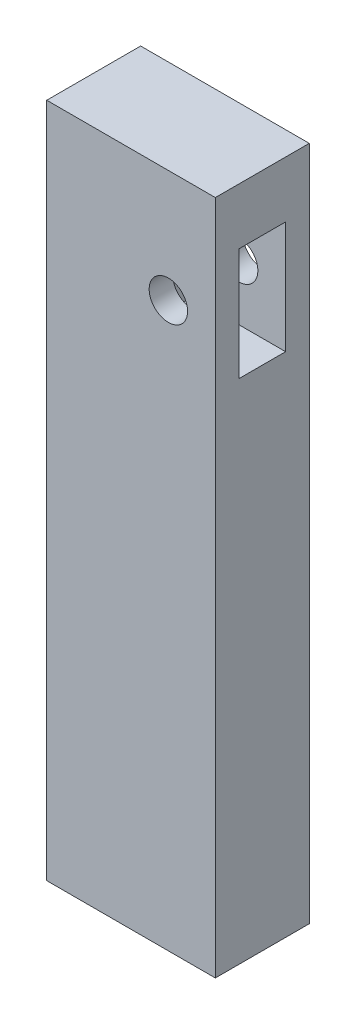
ISO-10303-21;
HEADER;
FILE_DESCRIPTION(('STEP AP214'),'2;1');
FILE_NAME('part.step','',(''),(''),'','','');
FILE_SCHEMA(('AUTOMOTIVE_DESIGN { 1 0 10303 214 1 1 1 1 }'));
ENDSEC;
DATA;
#1=APPLICATION_CONTEXT('core data for automotive mechanical design processes');
#2=APPLICATION_PROTOCOL_DEFINITION('international standard','automotive_design',2000,#1);
#3=PRODUCT_CONTEXT('',#1,'mechanical');
#4=PRODUCT('Part','Part','',(#3));
#5=PRODUCT_RELATED_PRODUCT_CATEGORY('part','',(#4));
#6=PRODUCT_DEFINITION_FORMATION('','',#4);
#7=PRODUCT_DEFINITION_CONTEXT('part definition',#1,'design');
#8=PRODUCT_DEFINITION('design','',#6,#7);
#9=PRODUCT_DEFINITION_SHAPE('','',#8);
#10=(LENGTH_UNIT() NAMED_UNIT(*) SI_UNIT(.MILLI.,.METRE.));
#11=(NAMED_UNIT(*) PLANE_ANGLE_UNIT() SI_UNIT($,.RADIAN.));
#12=(NAMED_UNIT(*) SI_UNIT($,.STERADIAN.) SOLID_ANGLE_UNIT());
#13=UNCERTAINTY_MEASURE_WITH_UNIT(LENGTH_MEASURE(1.E-05),#10,'distance_accuracy_value','');
#14=(GEOMETRIC_REPRESENTATION_CONTEXT(3) GLOBAL_UNCERTAINTY_ASSIGNED_CONTEXT((#13)) GLOBAL_UNIT_ASSIGNED_CONTEXT((#10,
#11,#12)) REPRESENTATION_CONTEXT('',''));
#15=CARTESIAN_POINT('',(0.,0.,0.));
#16=DIRECTION('',(0.,0.,1.));
#17=DIRECTION('',(1.,0.,0.));
#18=AXIS2_PLACEMENT_3D('',#15,#16,#17);
#19=CARTESIAN_POINT('',(114.,457.,127.));
#20=DIRECTION('',(-1.,0.,0.));
#21=DIRECTION('',(0.,-1.,0.));
#22=AXIS2_PLACEMENT_3D('',#19,#20,#21);
#23=PLANE('',#22);
#24=DIRECTION('',(0.,0.,1.));
#25=VECTOR('',#24,1.);
#26=CARTESIAN_POINT('',(114.,381.,95.));
#27=LINE('',#26,#25);
#28=CARTESIAN_POINT('',(114.,381.,32.));
#29=VERTEX_POINT('',#28);
#30=CARTESIAN_POINT('',(114.,381.,95.));
#31=VERTEX_POINT('',#30);
#32=EDGE_CURVE('E143',#29,#31,#27,.T.);
#33=ORIENTED_EDGE('',*,*,#32,.F.);
#34=DIRECTION('',(0.,1.,0.));
#35=VECTOR('',#34,1.);
#36=CARTESIAN_POINT('',(114.,381.,32.));
#37=LINE('',#36,#35);
#38=CARTESIAN_POINT('',(114.,229.,31.9999999999999));
#39=VERTEX_POINT('',#38);
#40=EDGE_CURVE('E52',#39,#29,#37,.T.);
#41=ORIENTED_EDGE('',*,*,#40,.F.);
#42=DIRECTION('',(0.,0.,-1.));
#43=VECTOR('',#42,1.);
#44=CARTESIAN_POINT('',(114.,229.,94.9999999999999));
#45=LINE('',#44,#43);
#46=CARTESIAN_POINT('',(114.,229.,94.9999999999999));
#47=VERTEX_POINT('',#46);
#48=EDGE_CURVE('E131',#47,#39,#45,.T.);
#49=ORIENTED_EDGE('',*,*,#48,.F.);
#50=DIRECTION('',(0.,-1.,0.));
#51=VECTOR('',#50,1.);
#52=CARTESIAN_POINT('',(114.,381.,95.));
#53=LINE('',#52,#51);
#54=EDGE_CURVE('E134',#31,#47,#53,.T.);
#55=ORIENTED_EDGE('',*,*,#54,.F.);
#56=EDGE_LOOP('',(#33,#41,#49,#55));
#57=FACE_BOUND('',#56,.T.);
#58=DIRECTION('',(0.,1.,0.));
#59=VECTOR('',#58,1.);
#60=CARTESIAN_POINT('',(114.,457.,0.));
#61=LINE('',#60,#59);
#62=CARTESIAN_POINT('',(114.,-457.,0.));
#63=VERTEX_POINT('',#62);
#64=CARTESIAN_POINT('',(114.,457.,0.));
#65=VERTEX_POINT('',#64);
#66=EDGE_CURVE('E149',#63,#65,#61,.T.);
#67=ORIENTED_EDGE('',*,*,#66,.T.);
#68=DIRECTION('',(0.,0.,-1.));
#69=VECTOR('',#68,1.);
#70=CARTESIAN_POINT('',(114.,457.,127.));
#71=LINE('',#70,#69);
#72=CARTESIAN_POINT('',(114.,457.,127.));
#73=VERTEX_POINT('',#72);
#74=EDGE_CURVE('E11',#73,#65,#71,.T.);
#75=ORIENTED_EDGE('',*,*,#74,.F.);
#76=DIRECTION('',(0.,1.,0.));
#77=VECTOR('',#76,1.);
#78=CARTESIAN_POINT('',(114.,457.,127.));
#79=LINE('',#78,#77);
#80=CARTESIAN_POINT('',(114.,-457.,127.));
#81=VERTEX_POINT('',#80);
#82=EDGE_CURVE('E153',#81,#73,#79,.T.);
#83=ORIENTED_EDGE('',*,*,#82,.F.);
#84=DIRECTION('',(0.,0.,-1.));
#85=VECTOR('',#84,1.);
#86=CARTESIAN_POINT('',(114.,-457.,127.));
#87=LINE('',#86,#85);
#88=EDGE_CURVE('E159',#81,#63,#87,.T.);
#89=ORIENTED_EDGE('',*,*,#88,.T.);
#90=EDGE_LOOP('',(#67,#75,#83,#89));
#91=FACE_BOUND('',#90,.T.);
#92=ADVANCED_FACE('F37',(#57,#91),#23,.F.);
#93=CARTESIAN_POINT('',(-114.,457.,127.));
#94=DIRECTION('',(0.,-1.,0.));
#95=DIRECTION('',(0.,0.,-1.));
#96=AXIS2_PLACEMENT_3D('',#93,#94,#95);
#97=PLANE('',#96);
#98=DIRECTION('',(-1.,0.,0.));
#99=VECTOR('',#98,1.);
#100=CARTESIAN_POINT('',(-114.,457.,0.));
#101=LINE('',#100,#99);
#102=CARTESIAN_POINT('',(-114.,457.,0.));
#103=VERTEX_POINT('',#102);
#104=EDGE_CURVE('E162',#65,#103,#101,.T.);
#105=ORIENTED_EDGE('',*,*,#104,.T.);
#106=DIRECTION('',(0.,0.,-1.));
#107=VECTOR('',#106,1.);
#108=CARTESIAN_POINT('',(-114.,457.,127.));
#109=LINE('',#108,#107);
#110=CARTESIAN_POINT('',(-114.,457.,127.));
#111=VERTEX_POINT('',#110);
#112=EDGE_CURVE('E45',#111,#103,#109,.T.);
#113=ORIENTED_EDGE('',*,*,#112,.F.);
#114=DIRECTION('',(-1.,0.,0.));
#115=VECTOR('',#114,1.);
#116=CARTESIAN_POINT('',(-114.,457.,127.));
#117=LINE('',#116,#115);
#118=EDGE_CURVE('E89',#73,#111,#117,.T.);
#119=ORIENTED_EDGE('',*,*,#118,.F.);
#120=ORIENTED_EDGE('',*,*,#74,.T.);
#121=EDGE_LOOP('',(#105,#113,#119,#120));
#122=FACE_BOUND('',#121,.T.);
#123=ADVANCED_FACE('F192',(#122),#97,.F.);
#124=CARTESIAN_POINT('',(-114.,457.,127.));
#125=DIRECTION('',(1.,0.,0.));
#126=DIRECTION('',(0.,1.,0.));
#127=AXIS2_PLACEMENT_3D('',#124,#125,#126);
#128=PLANE('',#127);
#129=DIRECTION('',(0.,-1.,0.));
#130=VECTOR('',#129,1.);
#131=CARTESIAN_POINT('',(-114.,457.,0.));
#132=LINE('',#131,#130);
#133=CARTESIAN_POINT('',(-114.,-457.,0.));
#134=VERTEX_POINT('',#133);
#135=EDGE_CURVE('E164',#103,#134,#132,.T.);
#136=ORIENTED_EDGE('',*,*,#135,.T.);
#137=DIRECTION('',(0.,0.,-1.));
#138=VECTOR('',#137,1.);
#139=CARTESIAN_POINT('',(-114.,-457.,127.));
#140=LINE('',#139,#138);
#141=CARTESIAN_POINT('',(-114.,-457.,127.));
#142=VERTEX_POINT('',#141);
#143=EDGE_CURVE('E168',#142,#134,#140,.T.);
#144=ORIENTED_EDGE('',*,*,#143,.F.);
#145=DIRECTION('',(0.,-1.,0.));
#146=VECTOR('',#145,1.);
#147=CARTESIAN_POINT('',(-114.,457.,127.));
#148=LINE('',#147,#146);
#149=EDGE_CURVE('E156',#111,#142,#148,.T.);
#150=ORIENTED_EDGE('',*,*,#149,.F.);
#151=ORIENTED_EDGE('',*,*,#112,.T.);
#152=EDGE_LOOP('',(#136,#144,#150,#151));
#153=FACE_BOUND('',#152,.T.);
#154=ADVANCED_FACE('F174',(#153),#128,.F.);
#155=CARTESIAN_POINT('',(-114.,-457.,127.));
#156=DIRECTION('',(0.,1.,0.));
#157=DIRECTION('',(0.,0.,1.));
#158=AXIS2_PLACEMENT_3D('',#155,#156,#157);
#159=PLANE('',#158);
#160=DIRECTION('',(1.,0.,0.));
#161=VECTOR('',#160,1.);
#162=CARTESIAN_POINT('',(-114.,-457.,0.));
#163=LINE('',#162,#161);
#164=EDGE_CURVE('E82',#134,#63,#163,.T.);
#165=ORIENTED_EDGE('',*,*,#164,.T.);
#166=ORIENTED_EDGE('',*,*,#88,.F.);
#167=DIRECTION('',(1.,0.,0.));
#168=VECTOR('',#167,1.);
#169=CARTESIAN_POINT('',(-114.,-457.,127.));
#170=LINE('',#169,#168);
#171=EDGE_CURVE('E61',#142,#81,#170,.T.);
#172=ORIENTED_EDGE('',*,*,#171,.F.);
#173=ORIENTED_EDGE('',*,*,#143,.T.);
#174=EDGE_LOOP('',(#165,#166,#172,#173));
#175=FACE_BOUND('',#174,.T.);
#176=ADVANCED_FACE('F182',(#175),#159,.F.);
#177=CARTESIAN_POINT('',(0.,0.,127.));
#178=DIRECTION('',(0.,0.,1.));
#179=DIRECTION('',(1.,0.,0.));
#180=AXIS2_PLACEMENT_3D('',#177,#178,#179);
#181=PLANE('',#180);
#182=CARTESIAN_POINT('',(50.5,305.,127.));
#183=DIRECTION('',(0.,0.,1.));
#184=DIRECTION('',(1.,0.,0.));
#185=AXIS2_PLACEMENT_3D('',#182,#183,#184);
#186=CIRCLE('',#185,26.);
#187=CARTESIAN_POINT('',(76.4999999999999,305.,127.));
#188=VERTEX_POINT('',#187);
#189=EDGE_CURVE('E228',#188,#188,#186,.T.);
#190=ORIENTED_EDGE('',*,*,#189,.F.);
#191=EDGE_LOOP('',(#190));
#192=FACE_BOUND('',#191,.T.);
#193=ORIENTED_EDGE('',*,*,#82,.T.);
#194=ORIENTED_EDGE('',*,*,#118,.T.);
#195=ORIENTED_EDGE('',*,*,#149,.T.);
#196=ORIENTED_EDGE('',*,*,#171,.T.);
#197=EDGE_LOOP('',(#193,#194,#195,#196));
#198=FACE_BOUND('',#197,.T.);
#199=ADVANCED_FACE('F184',(#192,#198),#181,.T.);
#200=CARTESIAN_POINT('',(0.,0.,0.));
#201=DIRECTION('',(0.,0.,1.));
#202=DIRECTION('',(1.,0.,0.));
#203=AXIS2_PLACEMENT_3D('',#200,#201,#202);
#204=PLANE('',#203);
#205=CARTESIAN_POINT('',(50.5,305.,0.));
#206=DIRECTION('',(0.,0.,1.));
#207=DIRECTION('',(1.,0.,0.));
#208=AXIS2_PLACEMENT_3D('',#205,#206,#207);
#209=CIRCLE('',#208,26.);
#210=CARTESIAN_POINT('',(76.4999999999999,305.,0.));
#211=VERTEX_POINT('',#210);
#212=EDGE_CURVE('E226',#211,#211,#209,.T.);
#213=ORIENTED_EDGE('',*,*,#212,.T.);
#214=EDGE_LOOP('',(#213));
#215=FACE_BOUND('',#214,.T.);
#216=ORIENTED_EDGE('',*,*,#66,.F.);
#217=ORIENTED_EDGE('',*,*,#164,.F.);
#218=ORIENTED_EDGE('',*,*,#135,.F.);
#219=ORIENTED_EDGE('',*,*,#104,.F.);
#220=EDGE_LOOP('',(#216,#217,#218,#219));
#221=FACE_BOUND('',#220,.T.);
#222=ADVANCED_FACE('F178',(#215,#221),#204,.F.);
#223=CARTESIAN_POINT('',(-13.0000000000001,381.,32.));
#224=DIRECTION('',(0.,0.,-1.));
#225=DIRECTION('',(0.,1.,0.));
#226=AXIS2_PLACEMENT_3D('',#223,#224,#225);
#227=PLANE('',#226);
#228=CARTESIAN_POINT('',(50.5,305.,31.9999999999999));
#229=DIRECTION('',(0.,0.,-1.));
#230=DIRECTION('',(0.,1.,0.));
#231=AXIS2_PLACEMENT_3D('',#228,#229,#230);
#232=CIRCLE('',#231,26.);
#233=CARTESIAN_POINT('',(50.5,331.,31.9999999999999));
#234=VERTEX_POINT('',#233);
#235=EDGE_CURVE('E137',#234,#234,#232,.F.);
#236=ORIENTED_EDGE('',*,*,#235,.F.);
#237=EDGE_LOOP('',(#236));
#238=FACE_BOUND('',#237,.T.);
#239=ORIENTED_EDGE('',*,*,#40,.T.);
#240=DIRECTION('',(1.,0.,0.));
#241=VECTOR('',#240,1.);
#242=CARTESIAN_POINT('',(-13.0000000000001,381.,32.));
#243=LINE('',#242,#241);
#244=CARTESIAN_POINT('',(-13.0000000000001,381.,32.));
#245=VERTEX_POINT('',#244);
#246=EDGE_CURVE('E109',#245,#29,#243,.T.);
#247=ORIENTED_EDGE('',*,*,#246,.F.);
#248=DIRECTION('',(0.,1.,0.));
#249=VECTOR('',#248,1.);
#250=CARTESIAN_POINT('',(-13.0000000000001,381.,32.));
#251=LINE('',#250,#249);
#252=CARTESIAN_POINT('',(-13.,229.,31.9999999999999));
#253=VERTEX_POINT('',#252);
#254=EDGE_CURVE('E113',#253,#245,#251,.T.);
#255=ORIENTED_EDGE('',*,*,#254,.F.);
#256=DIRECTION('',(1.,0.,0.));
#257=VECTOR('',#256,1.);
#258=CARTESIAN_POINT('',(-13.,229.,31.9999999999999));
#259=LINE('',#258,#257);
#260=EDGE_CURVE('E147',#253,#39,#259,.T.);
#261=ORIENTED_EDGE('',*,*,#260,.T.);
#262=EDGE_LOOP('',(#239,#247,#255,#261));
#263=FACE_BOUND('',#262,.T.);
#264=ADVANCED_FACE('F111',(#238,#263),#227,.F.);
#265=CARTESIAN_POINT('',(-13.,229.,94.9999999999999));
#266=DIRECTION('',(0.,-1.,0.));
#267=DIRECTION('',(1.,0.,0.));
#268=AXIS2_PLACEMENT_3D('',#265,#266,#267);
#269=PLANE('',#268);
#270=ORIENTED_EDGE('',*,*,#48,.T.);
#271=ORIENTED_EDGE('',*,*,#260,.F.);
#272=DIRECTION('',(0.,0.,-1.));
#273=VECTOR('',#272,1.);
#274=CARTESIAN_POINT('',(-13.,229.,94.9999999999999));
#275=LINE('',#274,#273);
#276=CARTESIAN_POINT('',(-13.,229.,94.9999999999999));
#277=VERTEX_POINT('',#276);
#278=EDGE_CURVE('E119',#277,#253,#275,.T.);
#279=ORIENTED_EDGE('',*,*,#278,.F.);
#280=DIRECTION('',(1.,0.,0.));
#281=VECTOR('',#280,1.);
#282=CARTESIAN_POINT('',(-13.,229.,94.9999999999999));
#283=LINE('',#282,#281);
#284=EDGE_CURVE('E150',#277,#47,#283,.T.);
#285=ORIENTED_EDGE('',*,*,#284,.T.);
#286=EDGE_LOOP('',(#270,#271,#279,#285));
#287=FACE_BOUND('',#286,.T.);
#288=ADVANCED_FACE('F205',(#287),#269,.F.);
#289=CARTESIAN_POINT('',(-13.0000000000001,381.,95.));
#290=DIRECTION('',(0.,0.,1.));
#291=DIRECTION('',(0.,-1.,0.));
#292=AXIS2_PLACEMENT_3D('',#289,#290,#291);
#293=PLANE('',#292);
#294=CARTESIAN_POINT('',(50.5,305.,94.9999999999999));
#295=DIRECTION('',(0.,0.,1.));
#296=DIRECTION('',(0.,-1.,0.));
#297=AXIS2_PLACEMENT_3D('',#294,#295,#296);
#298=CIRCLE('',#297,26.);
#299=CARTESIAN_POINT('',(50.5,279.,94.9999999999999));
#300=VERTEX_POINT('',#299);
#301=EDGE_CURVE('E40',#300,#300,#298,.F.);
#302=ORIENTED_EDGE('',*,*,#301,.F.);
#303=EDGE_LOOP('',(#302));
#304=FACE_BOUND('',#303,.T.);
#305=ORIENTED_EDGE('',*,*,#54,.T.);
#306=ORIENTED_EDGE('',*,*,#284,.F.);
#307=DIRECTION('',(0.,-1.,0.));
#308=VECTOR('',#307,1.);
#309=CARTESIAN_POINT('',(-13.0000000000001,381.,95.));
#310=LINE('',#309,#308);
#311=CARTESIAN_POINT('',(-13.0000000000001,381.,95.));
#312=VERTEX_POINT('',#311);
#313=EDGE_CURVE('E127',#312,#277,#310,.T.);
#314=ORIENTED_EDGE('',*,*,#313,.F.);
#315=DIRECTION('',(1.,0.,0.));
#316=VECTOR('',#315,1.);
#317=CARTESIAN_POINT('',(-13.0000000000001,381.,95.));
#318=LINE('',#317,#316);
#319=EDGE_CURVE('E118',#312,#31,#318,.T.);
#320=ORIENTED_EDGE('',*,*,#319,.T.);
#321=EDGE_LOOP('',(#305,#306,#314,#320));
#322=FACE_BOUND('',#321,.T.);
#323=ADVANCED_FACE('F203',(#304,#322),#293,.F.);
#324=CARTESIAN_POINT('',(-13.0000000000001,381.,95.));
#325=DIRECTION('',(0.,1.,0.));
#326=DIRECTION('',(-1.,0.,0.));
#327=AXIS2_PLACEMENT_3D('',#324,#325,#326);
#328=PLANE('',#327);
#329=ORIENTED_EDGE('',*,*,#32,.T.);
#330=ORIENTED_EDGE('',*,*,#319,.F.);
#331=DIRECTION('',(0.,0.,1.));
#332=VECTOR('',#331,1.);
#333=CARTESIAN_POINT('',(-13.0000000000001,381.,95.));
#334=LINE('',#333,#332);
#335=EDGE_CURVE('E122',#245,#312,#334,.T.);
#336=ORIENTED_EDGE('',*,*,#335,.F.);
#337=ORIENTED_EDGE('',*,*,#246,.T.);
#338=EDGE_LOOP('',(#329,#330,#336,#337));
#339=FACE_BOUND('',#338,.T.);
#340=ADVANCED_FACE('F123',(#339),#328,.F.);
#341=CARTESIAN_POINT('',(-13.,0.,0.));
#342=DIRECTION('',(1.,0.,0.));
#343=DIRECTION('',(0.,1.,0.));
#344=AXIS2_PLACEMENT_3D('',#341,#342,#343);
#345=PLANE('',#344);
#346=ORIENTED_EDGE('',*,*,#254,.T.);
#347=ORIENTED_EDGE('',*,*,#335,.T.);
#348=ORIENTED_EDGE('',*,*,#313,.T.);
#349=ORIENTED_EDGE('',*,*,#278,.T.);
#350=EDGE_LOOP('',(#346,#347,#348,#349));
#351=FACE_BOUND('',#350,.T.);
#352=ADVANCED_FACE('F129',(#351),#345,.T.);
#353=CARTESIAN_POINT('',(50.5,305.,127.));
#354=DIRECTION('',(0.,0.,-1.));
#355=DIRECTION('',(-1.,0.,0.));
#356=AXIS2_PLACEMENT_3D('',#353,#354,#355);
#357=CYLINDRICAL_SURFACE('',#356,26.);
#358=ORIENTED_EDGE('',*,*,#189,.T.);
#359=EDGE_LOOP('',(#358));
#360=FACE_BOUND('',#359,.T.);
#361=ORIENTED_EDGE('',*,*,#301,.T.);
#362=EDGE_LOOP('',(#361));
#363=FACE_BOUND('',#362,.T.);
#364=ADVANCED_FACE('F241',(#360,#363),#357,.F.);
#365=ORIENTED_EDGE('',*,*,#212,.F.);
#366=EDGE_LOOP('',(#365));
#367=FACE_BOUND('',#366,.T.);
#368=ORIENTED_EDGE('',*,*,#235,.T.);
#369=EDGE_LOOP('',(#368));
#370=FACE_BOUND('',#369,.T.);
#371=ADVANCED_FACE('F239',(#367,#370),#357,.F.);
#372=CLOSED_SHELL('',(#92,#123,#154,#176,#199,#222,#264,#288,#323,#340,#352,#364,#371));
#373=MANIFOLD_SOLID_BREP('B2',#372);
#374=ADVANCED_BREP_SHAPE_REPRESENTATION('',(#18,#373),#14);
#375=SHAPE_DEFINITION_REPRESENTATION(#9,#374);
ENDSEC;
END-ISO-10303-21;
